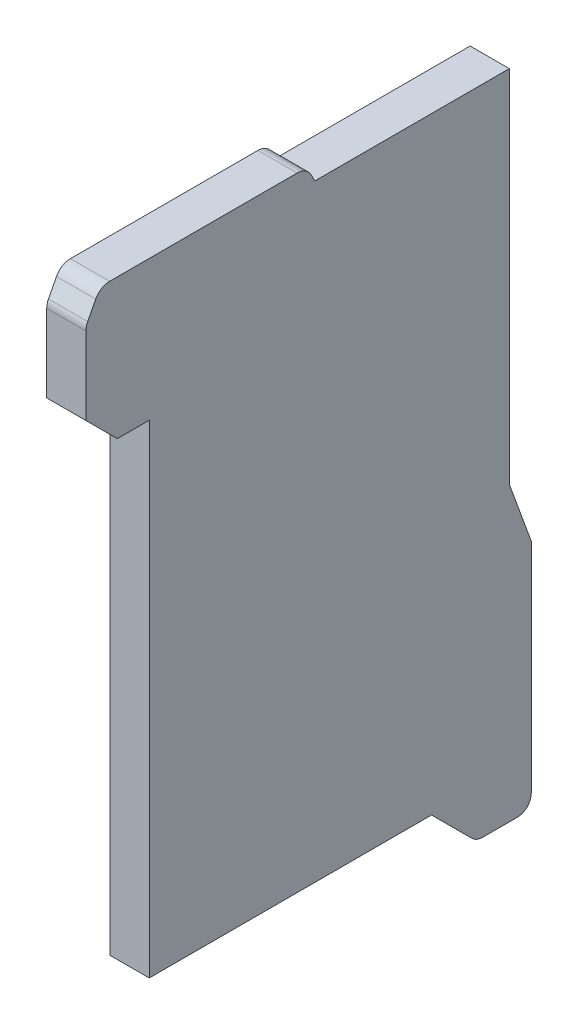
ISO-10303-21;
HEADER;
FILE_DESCRIPTION(('STEP AP214'),'2;1');
FILE_NAME('part.step','',(''),(''),'','','');
FILE_SCHEMA(('AUTOMOTIVE_DESIGN { 1 0 10303 214 1 1 1 1 }'));
ENDSEC;
DATA;
#1=APPLICATION_CONTEXT('core data for automotive mechanical design processes');
#2=APPLICATION_PROTOCOL_DEFINITION('international standard','automotive_design',2000,#1);
#3=PRODUCT_CONTEXT('',#1,'mechanical');
#4=PRODUCT('Part','Part','',(#3));
#5=PRODUCT_RELATED_PRODUCT_CATEGORY('part','',(#4));
#6=PRODUCT_DEFINITION_FORMATION('','',#4);
#7=PRODUCT_DEFINITION_CONTEXT('part definition',#1,'design');
#8=PRODUCT_DEFINITION('design','',#6,#7);
#9=PRODUCT_DEFINITION_SHAPE('','',#8);
#10=(LENGTH_UNIT() NAMED_UNIT(*) SI_UNIT(.MILLI.,.METRE.));
#11=(NAMED_UNIT(*) PLANE_ANGLE_UNIT() SI_UNIT($,.RADIAN.));
#12=(NAMED_UNIT(*) SI_UNIT($,.STERADIAN.) SOLID_ANGLE_UNIT());
#13=UNCERTAINTY_MEASURE_WITH_UNIT(LENGTH_MEASURE(1.E-05),#10,'distance_accuracy_value','');
#14=(GEOMETRIC_REPRESENTATION_CONTEXT(3) GLOBAL_UNCERTAINTY_ASSIGNED_CONTEXT((#13)) GLOBAL_UNIT_ASSIGNED_CONTEXT((#10,
#11,#12)) REPRESENTATION_CONTEXT('',''));
#15=CARTESIAN_POINT('',(0.,0.,0.));
#16=DIRECTION('',(0.,0.,1.));
#17=DIRECTION('',(1.,0.,0.));
#18=AXIS2_PLACEMENT_3D('',#15,#16,#17);
#19=CARTESIAN_POINT('',(13.655673101346,-13.05343535686,1.691472156339));
#20=DIRECTION('',(-1.,0.,0.));
#21=DIRECTION('',(0.,0.935066266637823,0.354472956649733));
#22=AXIS2_PLACEMENT_3D('',#19,#20,#21);
#23=CYLINDRICAL_SURFACE('',#22,0.1);
#24=CARTESIAN_POINT('',(13.655673101346,-13.05343535686,1.691472156339));
#25=DIRECTION('',(-1.,0.,0.));
#26=DIRECTION('',(0.,1.,0.));
#27=AXIS2_PLACEMENT_3D('',#24,#25,#26);
#28=CIRCLE('',#27,0.1);
#29=CARTESIAN_POINT('',(13.655673101346,-13.12830514146,1.6251810155));
#30=VERTEX_POINT('',#29);
#31=CARTESIAN_POINT('',(13.655673101346,-13.15343535686,1.691472156339));
#32=VERTEX_POINT('',#31);
#33=EDGE_CURVE('E11',#30,#32,#28,.T.);
#34=ORIENTED_EDGE('',*,*,#33,.T.);
#35=DIRECTION('',(-1.,0.,0.));
#36=VECTOR('',#35,1.);
#37=CARTESIAN_POINT('',(13.655673101346,-13.15343535686,1.691472156339));
#38=LINE('',#37,#36);
#39=CARTESIAN_POINT('',(13.405673101346,-13.15343535686,1.691472156339));
#40=VERTEX_POINT('',#39);
#41=EDGE_CURVE('E25',#32,#40,#38,.T.);
#42=ORIENTED_EDGE('',*,*,#41,.T.);
#43=CARTESIAN_POINT('',(13.405673101346,-13.05343535686,1.691472156339));
#44=DIRECTION('',(1.,0.,0.));
#45=DIRECTION('',(0.,1.,0.));
#46=AXIS2_PLACEMENT_3D('',#43,#44,#45);
#47=CIRCLE('',#46,0.1);
#48=CARTESIAN_POINT('',(13.405673101346,-13.12830514146,1.6251810155));
#49=VERTEX_POINT('',#48);
#50=EDGE_CURVE('E400',#40,#49,#47,.T.);
#51=ORIENTED_EDGE('',*,*,#50,.T.);
#52=DIRECTION('',(-1.,0.,0.));
#53=VECTOR('',#52,1.);
#54=CARTESIAN_POINT('',(13.530673101346,-13.12830514146,1.6251810155));
#55=LINE('',#54,#53);
#56=EDGE_CURVE('E395',#30,#49,#55,.T.);
#57=ORIENTED_EDGE('',*,*,#56,.F.);
#58=EDGE_LOOP('',(#34,#42,#51,#57));
#59=FACE_BOUND('',#58,.T.);
#60=ADVANCED_FACE('F17',(#59),#23,.T.);
#61=CARTESIAN_POINT('',(13.655673101346,-13.06201400062,1.700050800102));
#62=DIRECTION('',(-1.,0.,0.));
#63=DIRECTION('',(0.,0.354472956647036,0.935066266638846));
#64=AXIS2_PLACEMENT_3D('',#61,#62,#63);
#65=CYLINDRICAL_SURFACE('',#64,0.1);
#66=ORIENTED_EDGE('',*,*,#56,.T.);
#67=CARTESIAN_POINT('',(13.405673101346,-13.06201400062,1.700050800102));
#68=DIRECTION('',(1.,0.,0.));
#69=DIRECTION('',(0.,1.,0.));
#70=AXIS2_PLACEMENT_3D('',#67,#68,#69);
#71=CIRCLE('',#70,0.1);
#72=CARTESIAN_POINT('',(13.405673101346,-13.06201400062,1.600050800102));
#73=VERTEX_POINT('',#72);
#74=EDGE_CURVE('E391',#49,#73,#71,.T.);
#75=ORIENTED_EDGE('',*,*,#74,.T.);
#76=DIRECTION('',(1.,0.,0.));
#77=VECTOR('',#76,1.);
#78=CARTESIAN_POINT('',(13.655673101346,-13.06201400062,1.600050800102));
#79=LINE('',#78,#77);
#80=CARTESIAN_POINT('',(13.655673101346,-13.06201400062,1.600050800102));
#81=VERTEX_POINT('',#80);
#82=EDGE_CURVE('E173',#73,#81,#79,.T.);
#83=ORIENTED_EDGE('',*,*,#82,.T.);
#84=CARTESIAN_POINT('',(13.655673101346,-13.06201400062,1.700050800102));
#85=DIRECTION('',(-1.,0.,0.));
#86=DIRECTION('',(0.,1.,0.));
#87=AXIS2_PLACEMENT_3D('',#84,#85,#86);
#88=CIRCLE('',#87,0.1);
#89=EDGE_CURVE('E383',#81,#30,#88,.T.);
#90=ORIENTED_EDGE('',*,*,#89,.T.);
#91=EDGE_LOOP('',(#66,#75,#83,#90));
#92=FACE_BOUND('',#91,.T.);
#93=ADVANCED_FACE('F410',(#92),#65,.T.);
#94=CARTESIAN_POINT('',(13.655673101346,-9.003435356864,3.215050800102));
#95=DIRECTION('',(-1.,0.,0.));
#96=DIRECTION('',(0.,0.,1.));
#97=AXIS2_PLACEMENT_3D('',#94,#95,#96);
#98=PLANE('',#97);
#99=DIRECTION('',(0.,1.,0.));
#100=VECTOR('',#99,1.);
#101=CARTESIAN_POINT('',(13.655673101346,-9.067474943962,4.440050800102));
#102=LINE('',#101,#100);
#103=CARTESIAN_POINT('',(13.655673101346,-9.587014667728,4.440050800102));
#104=VERTEX_POINT('',#103);
#105=CARTESIAN_POINT('',(13.655673101346,-9.091912334242,4.440050800102));
#106=VERTEX_POINT('',#105);
#107=EDGE_CURVE('E378',#104,#106,#102,.T.);
#108=ORIENTED_EDGE('',*,*,#107,.F.);
#109=DIRECTION('',(0.,0.707106781186548,0.707106781186548));
#110=VECTOR('',#109,1.);
#111=CARTESIAN_POINT('',(13.655673101346,-9.587014667728,4.440050800102));
#112=LINE('',#111,#110);
#113=CARTESIAN_POINT('',(13.655673101346,-9.787014667728,4.240050800102));
#114=VERTEX_POINT('',#113);
#115=EDGE_CURVE('E373',#114,#104,#112,.T.);
#116=ORIENTED_EDGE('',*,*,#115,.F.);
#117=DIRECTION('',(0.,0.,1.));
#118=VECTOR('',#117,1.);
#119=CARTESIAN_POINT('',(13.655673101346,-9.787014667728,4.240050800102));
#120=LINE('',#119,#118);
#121=CARTESIAN_POINT('',(13.655673101346,-9.787014667728,4.036152362492));
#122=VERTEX_POINT('',#121);
#123=EDGE_CURVE('E368',#122,#114,#120,.T.);
#124=ORIENTED_EDGE('',*,*,#123,.F.);
#125=DIRECTION('',(0.,1.,0.));
#126=VECTOR('',#125,1.);
#127=CARTESIAN_POINT('',(13.655673101346,-9.787014667728,4.036152362492));
#128=LINE('',#127,#126);
#129=CARTESIAN_POINT('',(13.655673101346,-12.86733379447,4.036152362492));
#130=VERTEX_POINT('',#129);
#131=EDGE_CURVE('E363',#130,#122,#128,.T.);
#132=ORIENTED_EDGE('',*,*,#131,.F.);
#133=DIRECTION('',(0.,0.,1.));
#134=VECTOR('',#133,1.);
#135=CARTESIAN_POINT('',(13.655673101346,-12.86733379447,4.036152362492));
#136=LINE('',#135,#134);
#137=CARTESIAN_POINT('',(13.655673101346,-12.86733379447,2.236152362492));
#138=VERTEX_POINT('',#137);
#139=EDGE_CURVE('E358',#138,#130,#136,.T.);
#140=ORIENTED_EDGE('',*,*,#139,.F.);
#141=DIRECTION('',(0.,0.707106781186548,0.707106781186548));
#142=VECTOR('',#141,1.);
#143=CARTESIAN_POINT('',(13.655673101346,-12.86733379447,2.236152362492));
#144=LINE('',#143,#142);
#145=CARTESIAN_POINT('',(13.655673101346,-13.12414603498,1.979340121983));
#146=VERTEX_POINT('',#145);
#147=EDGE_CURVE('E353',#146,#138,#144,.T.);
#148=ORIENTED_EDGE('',*,*,#147,.F.);
#149=CARTESIAN_POINT('',(13.655673101346,-13.05343535686,1.908629443865));
#150=DIRECTION('',(-1.,0.,0.));
#151=DIRECTION('',(0.,1.,0.));
#152=AXIS2_PLACEMENT_3D('',#149,#150,#151);
#153=CIRCLE('',#152,0.1);
#154=CARTESIAN_POINT('',(13.655673101346,-13.15343535686,1.908629443865));
#155=VERTEX_POINT('',#154);
#156=EDGE_CURVE('E348',#155,#146,#153,.T.);
#157=ORIENTED_EDGE('',*,*,#156,.F.);
#158=DIRECTION('',(0.,0.,1.));
#159=VECTOR('',#158,1.);
#160=CARTESIAN_POINT('',(13.655673101346,-13.15343535686,1.950050800102));
#161=LINE('',#160,#159);
#162=EDGE_CURVE('E343',#32,#155,#161,.T.);
#163=ORIENTED_EDGE('',*,*,#162,.F.);
#164=ORIENTED_EDGE('',*,*,#33,.F.);
#165=ORIENTED_EDGE('',*,*,#89,.F.);
#166=DIRECTION('',(0.,-1.,0.));
#167=VECTOR('',#166,1.);
#168=CARTESIAN_POINT('',(13.655673101346,-13.10343535686,1.600050800102));
#169=LINE('',#168,#167);
#170=CARTESIAN_POINT('',(13.655673101346,-11.67343535686,1.600050800102));
#171=VERTEX_POINT('',#170);
#172=EDGE_CURVE('E339',#171,#81,#169,.T.);
#173=ORIENTED_EDGE('',*,*,#172,.F.);
#174=DIRECTION('',(0.,-0.939692620785813,-0.342020143325932));
#175=VECTOR('',#174,1.);
#176=CARTESIAN_POINT('',(13.655673101346,-11.67343535686,1.600050800102));
#177=LINE('',#176,#175);
#178=CARTESIAN_POINT('',(13.655673101346,-11.28878851814,1.740050800102));
#179=VERTEX_POINT('',#178);
#180=EDGE_CURVE('E167',#179,#171,#177,.T.);
#181=ORIENTED_EDGE('',*,*,#180,.F.);
#182=DIRECTION('',(0.,-1.,0.));
#183=VECTOR('',#182,1.);
#184=CARTESIAN_POINT('',(13.655673101346,-11.28878851814,1.740050800102));
#185=LINE('',#184,#183);
#186=CARTESIAN_POINT('',(13.655673101346,-8.993435356864,1.740050800102));
#187=VERTEX_POINT('',#186);
#188=EDGE_CURVE('E331',#187,#179,#185,.T.);
#189=ORIENTED_EDGE('',*,*,#188,.F.);
#190=DIRECTION('',(0.,0.,-1.));
#191=VECTOR('',#190,1.);
#192=CARTESIAN_POINT('',(13.655673101346,-8.993435356864,2.98007282391));
#193=LINE('',#192,#191);
#194=CARTESIAN_POINT('',(13.655673101346,-8.993435356864,2.98007282391));
#195=VERTEX_POINT('',#194);
#196=EDGE_CURVE('E326',#195,#187,#193,.T.);
#197=ORIENTED_EDGE('',*,*,#196,.F.);
#198=DIRECTION('',(0.,-0.882921285677773,-0.469521036053879));
#199=VECTOR('',#198,1.);
#200=CARTESIAN_POINT('',(13.655673101346,-8.893435356864,3.033250954698));
#201=LINE('',#200,#199);
#202=CARTESIAN_POINT('',(13.655673101346,-8.946483253259,3.005041074973));
#203=VERTEX_POINT('',#202);
#204=EDGE_CURVE('E321',#203,#195,#201,.T.);
#205=ORIENTED_EDGE('',*,*,#204,.F.);
#206=CARTESIAN_POINT('',(13.655673101346,-8.993435356864,3.093333203541));
#207=DIRECTION('',(-1.,0.,0.));
#208=DIRECTION('',(0.,1.,0.));
#209=AXIS2_PLACEMENT_3D('',#206,#207,#208);
#210=CIRCLE('',#209,0.1);
#211=CARTESIAN_POINT('',(13.655673101346,-8.893435356864,3.093333203541));
#212=VERTEX_POINT('',#211);
#213=EDGE_CURVE('E316',#212,#203,#210,.T.);
#214=ORIENTED_EDGE('',*,*,#213,.F.);
#215=DIRECTION('',(0.,0.,-1.));
#216=VECTOR('',#215,1.);
#217=CARTESIAN_POINT('',(13.655673101346,-8.893435356864,3.033250954698));
#218=LINE('',#217,#216);
#219=CARTESIAN_POINT('',(13.655673101346,-8.893435356864,4.288863563156));
#220=VERTEX_POINT('',#219);
#221=EDGE_CURVE('E311',#220,#212,#218,.T.);
#222=ORIENTED_EDGE('',*,*,#221,.F.);
#223=CARTESIAN_POINT('',(13.655673101346,-8.993435356864,4.288863563156));
#224=DIRECTION('',(-1.,0.,0.));
#225=DIRECTION('',(0.,1.,0.));
#226=AXIS2_PLACEMENT_3D('',#223,#224,#225);
#227=CIRCLE('',#226,0.1);
#228=CARTESIAN_POINT('',(13.655673101346,-8.947314829813,4.377592909962));
#229=VERTEX_POINT('',#228);
#230=EDGE_CURVE('E306',#229,#220,#227,.T.);
#231=ORIENTED_EDGE('',*,*,#230,.F.);
#232=DIRECTION('',(0.,0.887293468057386,-0.4612052705062));
#233=VECTOR('',#232,1.);
#234=CARTESIAN_POINT('',(13.655673101346,-8.893435356864,4.349586959517));
#235=LINE('',#234,#233);
#236=CARTESIAN_POINT('',(13.655673101346,-9.045791807191,4.428780146908));
#237=VERTEX_POINT('',#236);
#238=EDGE_CURVE('E301',#237,#229,#235,.T.);
#239=ORIENTED_EDGE('',*,*,#238,.F.);
#240=CARTESIAN_POINT('',(13.655673101346,-9.091912334242,4.340050800102));
#241=DIRECTION('',(-1.,0.,0.));
#242=DIRECTION('',(0.,1.,0.));
#243=AXIS2_PLACEMENT_3D('',#240,#241,#242);
#244=CIRCLE('',#243,0.1);
#245=EDGE_CURVE('E296',#106,#237,#244,.T.);
#246=ORIENTED_EDGE('',*,*,#245,.F.);
#247=EDGE_LOOP('',(#108,#116,#124,#132,#140,#148,#157,#163,#164,#165,#173,#181,#189,#197,#205,
#214,#222,#231,#239,#246));
#248=FACE_BOUND('',#247,.T.);
#249=ADVANCED_FACE('F413',(#248),#98,.F.);
#250=CARTESIAN_POINT('',(13.655673101346,-9.091912334242,4.340050800102));
#251=DIRECTION('',(-1.,0.,0.));
#252=DIRECTION('',(0.,-0.237388428470736,-0.971414810484272));
#253=AXIS2_PLACEMENT_3D('',#250,#251,#252);
#254=CYLINDRICAL_SURFACE('',#253,0.1);
#255=ORIENTED_EDGE('',*,*,#245,.T.);
#256=DIRECTION('',(-1.,0.,0.));
#257=VECTOR('',#256,1.);
#258=CARTESIAN_POINT('',(13.655673101346,-9.045791807191,4.428780146908));
#259=LINE('',#258,#257);
#260=CARTESIAN_POINT('',(13.405673101346,-9.045791807191,4.428780146908));
#261=VERTEX_POINT('',#260);
#262=EDGE_CURVE('E292',#237,#261,#259,.T.);
#263=ORIENTED_EDGE('',*,*,#262,.T.);
#264=CARTESIAN_POINT('',(13.405673101346,-9.091912334242,4.340050800102));
#265=DIRECTION('',(1.,0.,0.));
#266=DIRECTION('',(0.,1.,0.));
#267=AXIS2_PLACEMENT_3D('',#264,#265,#266);
#268=CIRCLE('',#267,0.1);
#269=CARTESIAN_POINT('',(13.405673101346,-9.091912334242,4.440050800102));
#270=VERTEX_POINT('',#269);
#271=EDGE_CURVE('E288',#261,#270,#268,.T.);
#272=ORIENTED_EDGE('',*,*,#271,.T.);
#273=DIRECTION('',(1.,0.,0.));
#274=VECTOR('',#273,1.);
#275=CARTESIAN_POINT('',(13.655673101346,-9.091912334242,4.440050800102));
#276=LINE('',#275,#274);
#277=EDGE_CURVE('E283',#270,#106,#276,.T.);
#278=ORIENTED_EDGE('',*,*,#277,.T.);
#279=EDGE_LOOP('',(#255,#263,#272,#278));
#280=FACE_BOUND('',#279,.T.);
#281=ADVANCED_FACE('F441',(#280),#254,.T.);
#282=CARTESIAN_POINT('',(13.655673101346,-9.067474943962,4.440050800102));
#283=DIRECTION('',(0.,0.,-1.));
#284=DIRECTION('',(-1.,0.,0.));
#285=AXIS2_PLACEMENT_3D('',#282,#283,#284);
#286=PLANE('',#285);
#287=ORIENTED_EDGE('',*,*,#107,.T.);
#288=ORIENTED_EDGE('',*,*,#277,.F.);
#289=DIRECTION('',(0.,1.,0.));
#290=VECTOR('',#289,1.);
#291=CARTESIAN_POINT('',(13.405673101346,-9.067474943962,4.440050800102));
#292=LINE('',#291,#290);
#293=CARTESIAN_POINT('',(13.405673101346,-9.587014667728,4.440050800102));
#294=VERTEX_POINT('',#293);
#295=EDGE_CURVE('E278',#294,#270,#292,.T.);
#296=ORIENTED_EDGE('',*,*,#295,.F.);
#297=DIRECTION('',(-1.,0.,0.));
#298=VECTOR('',#297,1.);
#299=CARTESIAN_POINT('',(13.655673101346,-9.587014667728,4.440050800102));
#300=LINE('',#299,#298);
#301=EDGE_CURVE('E273',#104,#294,#300,.T.);
#302=ORIENTED_EDGE('',*,*,#301,.F.);
#303=EDGE_LOOP('',(#287,#288,#296,#302));
#304=FACE_BOUND('',#303,.T.);
#305=ADVANCED_FACE('F439',(#304),#286,.F.);
#306=CARTESIAN_POINT('',(13.655673101346,-9.587014667728,4.440050800102));
#307=DIRECTION('',(0.,0.707106781186548,-0.707106781186548));
#308=DIRECTION('',(-1.,0.,0.));
#309=AXIS2_PLACEMENT_3D('',#306,#307,#308);
#310=PLANE('',#309);
#311=DIRECTION('',(0.,0.707106781186548,0.707106781186548));
#312=VECTOR('',#311,1.);
#313=CARTESIAN_POINT('',(13.405673101346,-9.587014667728,4.440050800102));
#314=LINE('',#313,#312);
#315=CARTESIAN_POINT('',(13.405673101346,-9.787014667728,4.240050800102));
#316=VERTEX_POINT('',#315);
#317=EDGE_CURVE('E268',#316,#294,#314,.T.);
#318=ORIENTED_EDGE('',*,*,#317,.F.);
#319=DIRECTION('',(-1.,0.,0.));
#320=VECTOR('',#319,1.);
#321=CARTESIAN_POINT('',(13.655673101346,-9.787014667728,4.240050800102));
#322=LINE('',#321,#320);
#323=EDGE_CURVE('E263',#114,#316,#322,.T.);
#324=ORIENTED_EDGE('',*,*,#323,.F.);
#325=ORIENTED_EDGE('',*,*,#115,.T.);
#326=ORIENTED_EDGE('',*,*,#301,.T.);
#327=EDGE_LOOP('',(#318,#324,#325,#326));
#328=FACE_BOUND('',#327,.T.);
#329=ADVANCED_FACE('F434',(#328),#310,.F.);
#330=CARTESIAN_POINT('',(13.655673101346,-9.787014667728,4.240050800102));
#331=DIRECTION('',(0.,1.,0.));
#332=DIRECTION('',(0.,0.,-1.));
#333=AXIS2_PLACEMENT_3D('',#330,#331,#332);
#334=PLANE('',#333);
#335=DIRECTION('',(0.,0.,1.));
#336=VECTOR('',#335,1.);
#337=CARTESIAN_POINT('',(13.405673101346,-9.787014667728,4.240050800102));
#338=LINE('',#337,#336);
#339=CARTESIAN_POINT('',(13.405673101346,-9.787014667728,4.036152362492));
#340=VERTEX_POINT('',#339);
#341=EDGE_CURVE('E258',#340,#316,#338,.T.);
#342=ORIENTED_EDGE('',*,*,#341,.F.);
#343=DIRECTION('',(-1.,0.,0.));
#344=VECTOR('',#343,1.);
#345=CARTESIAN_POINT('',(13.655673101346,-9.787014667728,4.036152362492));
#346=LINE('',#345,#344);
#347=EDGE_CURVE('E253',#122,#340,#346,.T.);
#348=ORIENTED_EDGE('',*,*,#347,.F.);
#349=ORIENTED_EDGE('',*,*,#123,.T.);
#350=ORIENTED_EDGE('',*,*,#323,.T.);
#351=EDGE_LOOP('',(#342,#348,#349,#350));
#352=FACE_BOUND('',#351,.T.);
#353=ADVANCED_FACE('F431',(#352),#334,.F.);
#354=CARTESIAN_POINT('',(13.655673101346,-9.787014667728,4.036152362492));
#355=DIRECTION('',(0.,0.,-1.));
#356=DIRECTION('',(-1.,0.,0.));
#357=AXIS2_PLACEMENT_3D('',#354,#355,#356);
#358=PLANE('',#357);
#359=DIRECTION('',(0.,1.,0.));
#360=VECTOR('',#359,1.);
#361=CARTESIAN_POINT('',(13.405673101346,-9.787014667728,4.036152362492));
#362=LINE('',#361,#360);
#363=CARTESIAN_POINT('',(13.405673101346,-12.86733379447,4.036152362492));
#364=VERTEX_POINT('',#363);
#365=EDGE_CURVE('E248',#364,#340,#362,.T.);
#366=ORIENTED_EDGE('',*,*,#365,.F.);
#367=DIRECTION('',(-1.,0.,0.));
#368=VECTOR('',#367,1.);
#369=CARTESIAN_POINT('',(13.655673101346,-12.86733379447,4.036152362492));
#370=LINE('',#369,#368);
#371=EDGE_CURVE('E243',#130,#364,#370,.T.);
#372=ORIENTED_EDGE('',*,*,#371,.F.);
#373=ORIENTED_EDGE('',*,*,#131,.T.);
#374=ORIENTED_EDGE('',*,*,#347,.T.);
#375=EDGE_LOOP('',(#366,#372,#373,#374));
#376=FACE_BOUND('',#375,.T.);
#377=ADVANCED_FACE('F429',(#376),#358,.F.);
#378=CARTESIAN_POINT('',(13.655673101346,-12.86733379447,4.036152362492));
#379=DIRECTION('',(0.,1.,0.));
#380=DIRECTION('',(0.,0.,-1.));
#381=AXIS2_PLACEMENT_3D('',#378,#379,#380);
#382=PLANE('',#381);
#383=DIRECTION('',(0.,0.,1.));
#384=VECTOR('',#383,1.);
#385=CARTESIAN_POINT('',(13.405673101346,-12.86733379447,4.036152362492));
#386=LINE('',#385,#384);
#387=CARTESIAN_POINT('',(13.405673101346,-12.86733379447,2.236152362492));
#388=VERTEX_POINT('',#387);
#389=EDGE_CURVE('E238',#388,#364,#386,.T.);
#390=ORIENTED_EDGE('',*,*,#389,.F.);
#391=DIRECTION('',(-1.,0.,0.));
#392=VECTOR('',#391,1.);
#393=CARTESIAN_POINT('',(13.655673101346,-12.86733379447,2.236152362492));
#394=LINE('',#393,#392);
#395=EDGE_CURVE('E233',#138,#388,#394,.T.);
#396=ORIENTED_EDGE('',*,*,#395,.F.);
#397=ORIENTED_EDGE('',*,*,#139,.T.);
#398=ORIENTED_EDGE('',*,*,#371,.T.);
#399=EDGE_LOOP('',(#390,#396,#397,#398));
#400=FACE_BOUND('',#399,.T.);
#401=ADVANCED_FACE('F425',(#400),#382,.F.);
#402=CARTESIAN_POINT('',(13.655673101346,-12.86733379447,2.236152362492));
#403=DIRECTION('',(0.,0.707106781186548,-0.707106781186548));
#404=DIRECTION('',(-1.,0.,0.));
#405=AXIS2_PLACEMENT_3D('',#402,#403,#404);
#406=PLANE('',#405);
#407=ORIENTED_EDGE('',*,*,#147,.T.);
#408=ORIENTED_EDGE('',*,*,#395,.T.);
#409=DIRECTION('',(0.,0.707106781186548,0.707106781186548));
#410=VECTOR('',#409,1.);
#411=CARTESIAN_POINT('',(13.405673101346,-12.86733379447,2.236152362492));
#412=LINE('',#411,#410);
#413=CARTESIAN_POINT('',(13.405673101346,-13.12414603498,1.979340121983));
#414=VERTEX_POINT('',#413);
#415=EDGE_CURVE('E228',#414,#388,#412,.T.);
#416=ORIENTED_EDGE('',*,*,#415,.F.);
#417=DIRECTION('',(-1.,0.,0.));
#418=VECTOR('',#417,1.);
#419=CARTESIAN_POINT('',(13.655673101346,-13.12414603498,1.979340121983));
#420=LINE('',#419,#418);
#421=EDGE_CURVE('E223',#146,#414,#420,.T.);
#422=ORIENTED_EDGE('',*,*,#421,.F.);
#423=EDGE_LOOP('',(#407,#408,#416,#422));
#424=FACE_BOUND('',#423,.T.);
#425=ADVANCED_FACE('F422',(#424),#406,.F.);
#426=CARTESIAN_POINT('',(13.655673101346,-13.05343535686,1.908629443865));
#427=DIRECTION('',(-1.,0.,0.));
#428=DIRECTION('',(0.,0.923879532513987,-0.382683432358572));
#429=AXIS2_PLACEMENT_3D('',#426,#427,#428);
#430=CYLINDRICAL_SURFACE('',#429,0.1);
#431=ORIENTED_EDGE('',*,*,#156,.T.);
#432=ORIENTED_EDGE('',*,*,#421,.T.);
#433=CARTESIAN_POINT('',(13.405673101346,-13.05343535686,1.908629443865));
#434=DIRECTION('',(1.,0.,0.));
#435=DIRECTION('',(0.,1.,0.));
#436=AXIS2_PLACEMENT_3D('',#433,#434,#435);
#437=CIRCLE('',#436,0.1);
#438=CARTESIAN_POINT('',(13.405673101346,-13.15343535686,1.908629443865));
#439=VERTEX_POINT('',#438);
#440=EDGE_CURVE('E219',#414,#439,#437,.T.);
#441=ORIENTED_EDGE('',*,*,#440,.T.);
#442=DIRECTION('',(1.,0.,0.));
#443=VECTOR('',#442,1.);
#444=CARTESIAN_POINT('',(13.655673101346,-13.15343535686,1.908629443865));
#445=LINE('',#444,#443);
#446=EDGE_CURVE('E214',#439,#155,#445,.T.);
#447=ORIENTED_EDGE('',*,*,#446,.T.);
#448=EDGE_LOOP('',(#431,#432,#441,#447));
#449=FACE_BOUND('',#448,.T.);
#450=ADVANCED_FACE('F420',(#449),#430,.T.);
#451=CARTESIAN_POINT('',(13.655673101346,-13.15343535686,1.950050800102));
#452=DIRECTION('',(0.,1.,0.));
#453=DIRECTION('',(0.,0.,-1.));
#454=AXIS2_PLACEMENT_3D('',#451,#452,#453);
#455=PLANE('',#454);
#456=DIRECTION('',(0.,0.,1.));
#457=VECTOR('',#456,1.);
#458=CARTESIAN_POINT('',(13.405673101346,-13.15343535686,1.950050800102));
#459=LINE('',#458,#457);
#460=EDGE_CURVE('E209',#40,#439,#459,.T.);
#461=ORIENTED_EDGE('',*,*,#460,.F.);
#462=ORIENTED_EDGE('',*,*,#41,.F.);
#463=ORIENTED_EDGE('',*,*,#162,.T.);
#464=ORIENTED_EDGE('',*,*,#446,.F.);
#465=EDGE_LOOP('',(#461,#462,#463,#464));
#466=FACE_BOUND('',#465,.T.);
#467=ADVANCED_FACE('F416',(#466),#455,.F.);
#468=CARTESIAN_POINT('',(13.405673101346,-9.003435356864,3.215050800102));
#469=DIRECTION('',(-1.,0.,0.));
#470=DIRECTION('',(0.,0.,1.));
#471=AXIS2_PLACEMENT_3D('',#468,#469,#470);
#472=PLANE('',#471);
#473=DIRECTION('',(0.,0.887293468057386,-0.4612052705062));
#474=VECTOR('',#473,1.);
#475=CARTESIAN_POINT('',(13.405673101346,-8.893435356864,4.349586959517));
#476=LINE('',#475,#474);
#477=CARTESIAN_POINT('',(13.405673101346,-8.947314829813,4.377592909962));
#478=VERTEX_POINT('',#477);
#479=EDGE_CURVE('E205',#261,#478,#476,.T.);
#480=ORIENTED_EDGE('',*,*,#479,.T.);
#481=CARTESIAN_POINT('',(13.405673101346,-8.993435356864,4.288863563156));
#482=DIRECTION('',(1.,0.,0.));
#483=DIRECTION('',(0.,1.,0.));
#484=AXIS2_PLACEMENT_3D('',#481,#482,#483);
#485=CIRCLE('',#484,0.1);
#486=CARTESIAN_POINT('',(13.405673101346,-8.893435356864,4.288863563156));
#487=VERTEX_POINT('',#486);
#488=EDGE_CURVE('E200',#487,#478,#485,.T.);
#489=ORIENTED_EDGE('',*,*,#488,.F.);
#490=DIRECTION('',(0.,0.,-1.));
#491=VECTOR('',#490,1.);
#492=CARTESIAN_POINT('',(13.405673101346,-8.893435356864,3.033250954698));
#493=LINE('',#492,#491);
#494=CARTESIAN_POINT('',(13.405673101346,-8.893435356864,3.093333203541));
#495=VERTEX_POINT('',#494);
#496=EDGE_CURVE('E196',#487,#495,#493,.T.);
#497=ORIENTED_EDGE('',*,*,#496,.T.);
#498=CARTESIAN_POINT('',(13.405673101346,-8.993435356864,3.093333203541));
#499=DIRECTION('',(1.,0.,0.));
#500=DIRECTION('',(0.,1.,0.));
#501=AXIS2_PLACEMENT_3D('',#498,#499,#500);
#502=CIRCLE('',#501,0.1);
#503=CARTESIAN_POINT('',(13.405673101346,-8.946483253259,3.005041074973));
#504=VERTEX_POINT('',#503);
#505=EDGE_CURVE('E191',#504,#495,#502,.T.);
#506=ORIENTED_EDGE('',*,*,#505,.F.);
#507=DIRECTION('',(0.,-0.882921285677773,-0.469521036053879));
#508=VECTOR('',#507,1.);
#509=CARTESIAN_POINT('',(13.405673101346,-8.893435356864,3.033250954698));
#510=LINE('',#509,#508);
#511=CARTESIAN_POINT('',(13.405673101346,-8.993435356864,2.98007282391));
#512=VERTEX_POINT('',#511);
#513=EDGE_CURVE('E187',#504,#512,#510,.T.);
#514=ORIENTED_EDGE('',*,*,#513,.T.);
#515=DIRECTION('',(0.,0.,-1.));
#516=VECTOR('',#515,1.);
#517=CARTESIAN_POINT('',(13.405673101346,-8.993435356864,2.98007282391));
#518=LINE('',#517,#516);
#519=CARTESIAN_POINT('',(13.405673101346,-8.993435356864,1.740050800102));
#520=VERTEX_POINT('',#519);
#521=EDGE_CURVE('E183',#512,#520,#518,.T.);
#522=ORIENTED_EDGE('',*,*,#521,.T.);
#523=DIRECTION('',(0.,-1.,0.));
#524=VECTOR('',#523,1.);
#525=CARTESIAN_POINT('',(13.405673101346,-11.28878851814,1.740050800102));
#526=LINE('',#525,#524);
#527=CARTESIAN_POINT('',(13.405673101346,-11.28878851814,1.740050800102));
#528=VERTEX_POINT('',#527);
#529=EDGE_CURVE('E158',#520,#528,#526,.T.);
#530=ORIENTED_EDGE('',*,*,#529,.T.);
#531=DIRECTION('',(0.,-0.939692620785813,-0.342020143325932));
#532=VECTOR('',#531,1.);
#533=CARTESIAN_POINT('',(13.405673101346,-11.67343535686,1.600050800102));
#534=LINE('',#533,#532);
#535=CARTESIAN_POINT('',(13.405673101346,-11.67343535686,1.600050800102));
#536=VERTEX_POINT('',#535);
#537=EDGE_CURVE('E150',#528,#536,#534,.T.);
#538=ORIENTED_EDGE('',*,*,#537,.T.);
#539=DIRECTION('',(0.,-1.,0.));
#540=VECTOR('',#539,1.);
#541=CARTESIAN_POINT('',(13.405673101346,-13.10343535686,1.600050800102));
#542=LINE('',#541,#540);
#543=EDGE_CURVE('E155',#536,#73,#542,.T.);
#544=ORIENTED_EDGE('',*,*,#543,.T.);
#545=ORIENTED_EDGE('',*,*,#74,.F.);
#546=ORIENTED_EDGE('',*,*,#50,.F.);
#547=ORIENTED_EDGE('',*,*,#460,.T.);
#548=ORIENTED_EDGE('',*,*,#440,.F.);
#549=ORIENTED_EDGE('',*,*,#415,.T.);
#550=ORIENTED_EDGE('',*,*,#389,.T.);
#551=ORIENTED_EDGE('',*,*,#365,.T.);
#552=ORIENTED_EDGE('',*,*,#341,.T.);
#553=ORIENTED_EDGE('',*,*,#317,.T.);
#554=ORIENTED_EDGE('',*,*,#295,.T.);
#555=ORIENTED_EDGE('',*,*,#271,.F.);
#556=EDGE_LOOP('',(#480,#489,#497,#506,#514,#522,#530,#538,#544,#545,#546,#547,#548,#549,#550,
#551,#552,#553,#554,#555));
#557=FACE_BOUND('',#556,.T.);
#558=ADVANCED_FACE('F152',(#557),#472,.T.);
#559=CARTESIAN_POINT('',(13.655673101346,-13.10343535686,1.600050800102));
#560=DIRECTION('',(0.,0.,1.));
#561=DIRECTION('',(0.,-1.,0.));
#562=AXIS2_PLACEMENT_3D('',#559,#560,#561);
#563=PLANE('',#562);
#564=ORIENTED_EDGE('',*,*,#543,.F.);
#565=DIRECTION('',(-1.,0.,0.));
#566=VECTOR('',#565,1.);
#567=CARTESIAN_POINT('',(13.655673101346,-11.67343535686,1.600050800102));
#568=LINE('',#567,#566);
#569=EDGE_CURVE('E165',#171,#536,#568,.T.);
#570=ORIENTED_EDGE('',*,*,#569,.F.);
#571=ORIENTED_EDGE('',*,*,#172,.T.);
#572=ORIENTED_EDGE('',*,*,#82,.F.);
#573=EDGE_LOOP('',(#564,#570,#571,#572));
#574=FACE_BOUND('',#573,.T.);
#575=ADVANCED_FACE('F172',(#574),#563,.F.);
#576=CARTESIAN_POINT('',(13.655673101346,-11.67343535686,1.600050800102));
#577=DIRECTION('',(0.,-0.342020143325932,0.939692620785813));
#578=DIRECTION('',(-1.,0.,0.));
#579=AXIS2_PLACEMENT_3D('',#576,#577,#578);
#580=PLANE('',#579);
#581=ORIENTED_EDGE('',*,*,#537,.F.);
#582=DIRECTION('',(-1.,0.,0.));
#583=VECTOR('',#582,1.);
#584=CARTESIAN_POINT('',(13.655673101346,-11.28878851814,1.740050800102));
#585=LINE('',#584,#583);
#586=EDGE_CURVE('E170',#179,#528,#585,.T.);
#587=ORIENTED_EDGE('',*,*,#586,.F.);
#588=ORIENTED_EDGE('',*,*,#180,.T.);
#589=ORIENTED_EDGE('',*,*,#569,.T.);
#590=EDGE_LOOP('',(#581,#587,#588,#589));
#591=FACE_BOUND('',#590,.T.);
#592=ADVANCED_FACE('F166',(#591),#580,.F.);
#593=CARTESIAN_POINT('',(13.655673101346,-11.28878851814,1.740050800102));
#594=DIRECTION('',(0.,0.,1.));
#595=DIRECTION('',(0.,-1.,0.));
#596=AXIS2_PLACEMENT_3D('',#593,#594,#595);
#597=PLANE('',#596);
#598=ORIENTED_EDGE('',*,*,#529,.F.);
#599=DIRECTION('',(-1.,0.,0.));
#600=VECTOR('',#599,1.);
#601=CARTESIAN_POINT('',(13.655673101346,-8.993435356864,1.740050800102));
#602=LINE('',#601,#600);
#603=EDGE_CURVE('E476',#187,#520,#602,.T.);
#604=ORIENTED_EDGE('',*,*,#603,.F.);
#605=ORIENTED_EDGE('',*,*,#188,.T.);
#606=ORIENTED_EDGE('',*,*,#586,.T.);
#607=EDGE_LOOP('',(#598,#604,#605,#606));
#608=FACE_BOUND('',#607,.T.);
#609=ADVANCED_FACE('F482',(#608),#597,.F.);
#610=CARTESIAN_POINT('',(13.655673101346,-8.993435356864,2.98007282391));
#611=DIRECTION('',(0.,-1.,0.));
#612=DIRECTION('',(0.,0.,-1.));
#613=AXIS2_PLACEMENT_3D('',#610,#611,#612);
#614=PLANE('',#613);
#615=ORIENTED_EDGE('',*,*,#521,.F.);
#616=DIRECTION('',(-1.,0.,0.));
#617=VECTOR('',#616,1.);
#618=CARTESIAN_POINT('',(13.655673101346,-8.993435356864,2.98007282391));
#619=LINE('',#618,#617);
#620=EDGE_CURVE('E473',#195,#512,#619,.T.);
#621=ORIENTED_EDGE('',*,*,#620,.F.);
#622=ORIENTED_EDGE('',*,*,#196,.T.);
#623=ORIENTED_EDGE('',*,*,#603,.T.);
#624=EDGE_LOOP('',(#615,#621,#622,#623));
#625=FACE_BOUND('',#624,.T.);
#626=ADVANCED_FACE('F478',(#625),#614,.F.);
#627=CARTESIAN_POINT('',(13.655673101346,-8.893435356864,3.033250954698));
#628=DIRECTION('',(0.,-0.469521036053879,0.882921285677773));
#629=DIRECTION('',(-1.,0.,0.));
#630=AXIS2_PLACEMENT_3D('',#627,#628,#629);
#631=PLANE('',#630);
#632=ORIENTED_EDGE('',*,*,#204,.T.);
#633=ORIENTED_EDGE('',*,*,#620,.T.);
#634=ORIENTED_EDGE('',*,*,#513,.F.);
#635=DIRECTION('',(-1.,0.,0.));
#636=VECTOR('',#635,1.);
#637=CARTESIAN_POINT('',(13.655673101346,-8.946483253259,3.005041074973));
#638=LINE('',#637,#636);
#639=EDGE_CURVE('E462',#203,#504,#638,.T.);
#640=ORIENTED_EDGE('',*,*,#639,.F.);
#641=EDGE_LOOP('',(#632,#633,#634,#640));
#642=FACE_BOUND('',#641,.T.);
#643=ADVANCED_FACE('F474',(#642),#631,.F.);
#644=CARTESIAN_POINT('',(13.655673101346,-8.993435356864,3.093333203541));
#645=DIRECTION('',(-1.,0.,0.));
#646=DIRECTION('',(0.,-0.857181729871185,0.515014059978019));
#647=AXIS2_PLACEMENT_3D('',#644,#645,#646);
#648=CYLINDRICAL_SURFACE('',#647,0.1);
#649=ORIENTED_EDGE('',*,*,#213,.T.);
#650=ORIENTED_EDGE('',*,*,#639,.T.);
#651=ORIENTED_EDGE('',*,*,#505,.T.);
#652=DIRECTION('',(1.,0.,0.));
#653=VECTOR('',#652,1.);
#654=CARTESIAN_POINT('',(13.655673101346,-8.893435356864,3.093333203541));
#655=LINE('',#654,#653);
#656=EDGE_CURVE('E457',#495,#212,#655,.T.);
#657=ORIENTED_EDGE('',*,*,#656,.T.);
#658=EDGE_LOOP('',(#649,#650,#651,#657));
#659=FACE_BOUND('',#658,.T.);
#660=ADVANCED_FACE('F465',(#659),#648,.T.);
#661=CARTESIAN_POINT('',(13.655673101346,-8.893435356864,3.033250954698));
#662=DIRECTION('',(0.,-1.,0.));
#663=DIRECTION('',(0.,0.,-1.));
#664=AXIS2_PLACEMENT_3D('',#661,#662,#663);
#665=PLANE('',#664);
#666=ORIENTED_EDGE('',*,*,#221,.T.);
#667=ORIENTED_EDGE('',*,*,#656,.F.);
#668=ORIENTED_EDGE('',*,*,#496,.F.);
#669=DIRECTION('',(-1.,0.,0.));
#670=VECTOR('',#669,1.);
#671=CARTESIAN_POINT('',(13.655673101346,-8.893435356864,4.288863563156));
#672=LINE('',#671,#670);
#673=EDGE_CURVE('E454',#220,#487,#672,.T.);
#674=ORIENTED_EDGE('',*,*,#673,.F.);
#675=EDGE_LOOP('',(#666,#667,#668,#674));
#676=FACE_BOUND('',#675,.T.);
#677=ADVANCED_FACE('F459',(#676),#665,.F.);
#678=CARTESIAN_POINT('',(13.655673101346,-8.993435356864,4.288863563156));
#679=DIRECTION('',(-1.,0.,0.));
#680=DIRECTION('',(0.,-0.854752965369973,-0.519035035610543));
#681=AXIS2_PLACEMENT_3D('',#678,#679,#680);
#682=CYLINDRICAL_SURFACE('',#681,0.1);
#683=ORIENTED_EDGE('',*,*,#230,.T.);
#684=ORIENTED_EDGE('',*,*,#673,.T.);
#685=ORIENTED_EDGE('',*,*,#488,.T.);
#686=DIRECTION('',(1.,0.,0.));
#687=VECTOR('',#686,1.);
#688=CARTESIAN_POINT('',(13.655673101346,-8.947314829813,4.377592909962));
#689=LINE('',#688,#687);
#690=EDGE_CURVE('E448',#478,#229,#689,.T.);
#691=ORIENTED_EDGE('',*,*,#690,.T.);
#692=EDGE_LOOP('',(#683,#684,#685,#691));
#693=FACE_BOUND('',#692,.T.);
#694=ADVANCED_FACE('F455',(#693),#682,.T.);
#695=CARTESIAN_POINT('',(13.655673101346,-8.893435356864,4.349586959517));
#696=DIRECTION('',(0.,-0.4612052705062,-0.887293468057386));
#697=DIRECTION('',(0.,-0.887293468057386,0.4612052705062));
#698=AXIS2_PLACEMENT_3D('',#695,#696,#697);
#699=PLANE('',#698);
#700=ORIENTED_EDGE('',*,*,#238,.T.);
#701=ORIENTED_EDGE('',*,*,#690,.F.);
#702=ORIENTED_EDGE('',*,*,#479,.F.);
#703=ORIENTED_EDGE('',*,*,#262,.F.);
#704=EDGE_LOOP('',(#700,#701,#702,#703));
#705=FACE_BOUND('',#704,.T.);
#706=ADVANCED_FACE('F446',(#705),#699,.F.);
#707=CLOSED_SHELL('',(#60,#93,#249,#281,#305,#329,#353,#377,#401,#425,#450,#467,#558,#575,#592,
#609,#626,#643,#660,#677,#694,#706));
#708=MANIFOLD_SOLID_BREP('B1',#707);
#709=ADVANCED_BREP_SHAPE_REPRESENTATION('',(#18,#708),#14);
#710=SHAPE_DEFINITION_REPRESENTATION(#9,#709);
ENDSEC;
END-ISO-10303-21;
